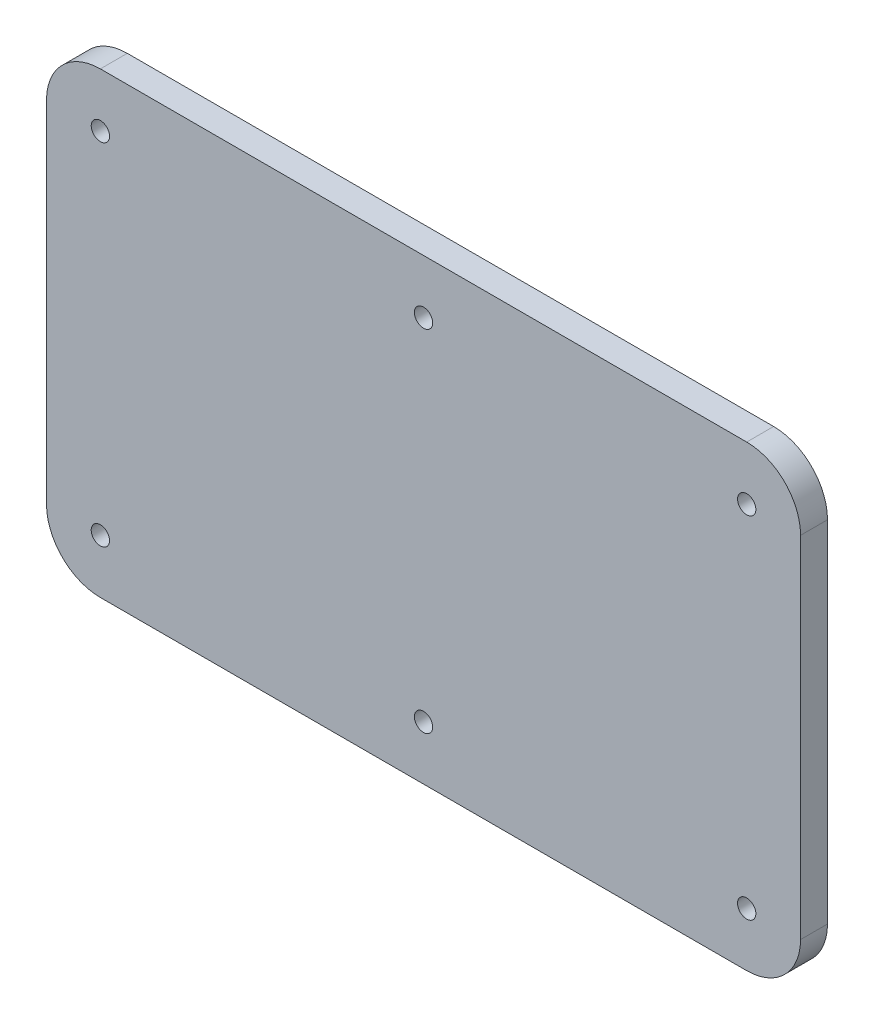
ISO-10303-21;
HEADER;
FILE_DESCRIPTION(('STEP AP214'),'2;1');
FILE_NAME('part.step','',(''),(''),'','','');
FILE_SCHEMA(('AUTOMOTIVE_DESIGN { 1 0 10303 214 1 1 1 1 }'));
ENDSEC;
DATA;
#1=APPLICATION_CONTEXT('core data for automotive mechanical design processes');
#2=APPLICATION_PROTOCOL_DEFINITION('international standard','automotive_design',2000,#1);
#3=PRODUCT_CONTEXT('',#1,'mechanical');
#4=PRODUCT('Part','Part','',(#3));
#5=PRODUCT_RELATED_PRODUCT_CATEGORY('part','',(#4));
#6=PRODUCT_DEFINITION_FORMATION('','',#4);
#7=PRODUCT_DEFINITION_CONTEXT('part definition',#1,'design');
#8=PRODUCT_DEFINITION('design','',#6,#7);
#9=PRODUCT_DEFINITION_SHAPE('','',#8);
#10=(LENGTH_UNIT() NAMED_UNIT(*) SI_UNIT(.MILLI.,.METRE.));
#11=(NAMED_UNIT(*) PLANE_ANGLE_UNIT() SI_UNIT($,.RADIAN.));
#12=(NAMED_UNIT(*) SI_UNIT($,.STERADIAN.) SOLID_ANGLE_UNIT());
#13=UNCERTAINTY_MEASURE_WITH_UNIT(LENGTH_MEASURE(1.E-05),#10,'distance_accuracy_value','');
#14=(GEOMETRIC_REPRESENTATION_CONTEXT(3) GLOBAL_UNCERTAINTY_ASSIGNED_CONTEXT((#13)) GLOBAL_UNIT_ASSIGNED_CONTEXT((#10,
#11,#12)) REPRESENTATION_CONTEXT('',''));
#15=CARTESIAN_POINT('',(0.,0.,0.));
#16=DIRECTION('',(0.,0.,1.));
#17=DIRECTION('',(1.,0.,0.));
#18=AXIS2_PLACEMENT_3D('',#15,#16,#17);
#19=CARTESIAN_POINT('',(-60.,32.5,5.));
#20=DIRECTION('',(0.,0.,1.));
#21=DIRECTION('',(1.,0.,0.));
#22=AXIS2_PLACEMENT_3D('',#19,#20,#21);
#23=PLANE('',#22);
#24=CARTESIAN_POINT('',(0.,32.5,5.));
#25=DIRECTION('',(0.,0.,1.));
#26=DIRECTION('',(1.,0.,0.));
#27=AXIS2_PLACEMENT_3D('',#24,#25,#26);
#28=CIRCLE('',#27,1.7);
#29=CARTESIAN_POINT('',(1.69999999999999,32.5,5.));
#30=VERTEX_POINT('',#29);
#31=EDGE_CURVE('E203',#30,#30,#28,.T.);
#32=ORIENTED_EDGE('',*,*,#31,.F.);
#33=EDGE_LOOP('',(#32));
#34=FACE_BOUND('',#33,.T.);
#35=CARTESIAN_POINT('',(60.,-32.5,5.));
#36=DIRECTION('',(0.,0.,1.));
#37=DIRECTION('',(1.,0.,0.));
#38=AXIS2_PLACEMENT_3D('',#35,#36,#37);
#39=CIRCLE('',#38,1.7);
#40=CARTESIAN_POINT('',(61.7,-32.5,5.));
#41=VERTEX_POINT('',#40);
#42=EDGE_CURVE('E191',#41,#41,#39,.T.);
#43=ORIENTED_EDGE('',*,*,#42,.F.);
#44=EDGE_LOOP('',(#43));
#45=FACE_BOUND('',#44,.T.);
#46=CARTESIAN_POINT('',(-60.,32.5,5.));
#47=DIRECTION('',(0.,0.,1.));
#48=DIRECTION('',(1.,0.,0.));
#49=AXIS2_PLACEMENT_3D('',#46,#47,#48);
#50=CIRCLE('',#49,1.7);
#51=CARTESIAN_POINT('',(-58.3,32.5,5.));
#52=VERTEX_POINT('',#51);
#53=EDGE_CURVE('E137',#52,#52,#50,.T.);
#54=ORIENTED_EDGE('',*,*,#53,.F.);
#55=EDGE_LOOP('',(#54));
#56=FACE_BOUND('',#55,.T.);
#57=CARTESIAN_POINT('',(-60.,32.5,5.));
#58=DIRECTION('',(0.,0.,1.));
#59=DIRECTION('',(1.,0.,0.));
#60=AXIS2_PLACEMENT_3D('',#57,#58,#59);
#61=CIRCLE('',#60,9.99999999999999);
#62=CARTESIAN_POINT('',(-59.9999999999999,42.5,5.));
#63=VERTEX_POINT('',#62);
#64=CARTESIAN_POINT('',(-70.,32.4999999999999,5.));
#65=VERTEX_POINT('',#64);
#66=EDGE_CURVE('E148',#63,#65,#61,.T.);
#67=ORIENTED_EDGE('',*,*,#66,.T.);
#68=DIRECTION('',(0.,-1.,0.));
#69=VECTOR('',#68,1.);
#70=CARTESIAN_POINT('',(-70.,-32.4999999999999,5.));
#71=LINE('',#70,#69);
#72=CARTESIAN_POINT('',(-70.,-32.5,5.));
#73=VERTEX_POINT('',#72);
#74=EDGE_CURVE('E96',#65,#73,#71,.T.);
#75=ORIENTED_EDGE('',*,*,#74,.T.);
#76=CARTESIAN_POINT('',(-60.,-32.5,5.));
#77=DIRECTION('',(0.,0.,1.));
#78=DIRECTION('',(-1.,0.,0.));
#79=AXIS2_PLACEMENT_3D('',#76,#77,#78);
#80=CIRCLE('',#79,9.99999999999999);
#81=CARTESIAN_POINT('',(-59.9999999999999,-42.5,5.));
#82=VERTEX_POINT('',#81);
#83=EDGE_CURVE('E163',#73,#82,#80,.T.);
#84=ORIENTED_EDGE('',*,*,#83,.T.);
#85=DIRECTION('',(1.,0.,0.));
#86=VECTOR('',#85,1.);
#87=CARTESIAN_POINT('',(-59.9999999999999,-42.5,5.));
#88=LINE('',#87,#86);
#89=CARTESIAN_POINT('',(59.9999999999999,-42.5,5.));
#90=VERTEX_POINT('',#89);
#91=EDGE_CURVE('E176',#82,#90,#88,.T.);
#92=ORIENTED_EDGE('',*,*,#91,.T.);
#93=CARTESIAN_POINT('',(60.,-32.5,5.));
#94=DIRECTION('',(0.,0.,1.));
#95=DIRECTION('',(-1.,0.,0.));
#96=AXIS2_PLACEMENT_3D('',#93,#94,#95);
#97=CIRCLE('',#96,9.99999999999999);
#98=CARTESIAN_POINT('',(70.,-32.4999999999999,5.));
#99=VERTEX_POINT('',#98);
#100=EDGE_CURVE('E115',#90,#99,#97,.T.);
#101=ORIENTED_EDGE('',*,*,#100,.T.);
#102=DIRECTION('',(0.,1.,0.));
#103=VECTOR('',#102,1.);
#104=CARTESIAN_POINT('',(70.,-32.4999999999999,5.));
#105=LINE('',#104,#103);
#106=CARTESIAN_POINT('',(70.,32.4999999999999,5.));
#107=VERTEX_POINT('',#106);
#108=EDGE_CURVE('E109',#99,#107,#105,.T.);
#109=ORIENTED_EDGE('',*,*,#108,.T.);
#110=CARTESIAN_POINT('',(60.,32.5,5.));
#111=DIRECTION('',(0.,0.,1.));
#112=DIRECTION('',(1.,0.,0.));
#113=AXIS2_PLACEMENT_3D('',#110,#111,#112);
#114=CIRCLE('',#113,9.99999999999999);
#115=CARTESIAN_POINT('',(59.9999999999999,42.5,5.));
#116=VERTEX_POINT('',#115);
#117=EDGE_CURVE('E113',#107,#116,#114,.T.);
#118=ORIENTED_EDGE('',*,*,#117,.T.);
#119=DIRECTION('',(-1.,0.,0.));
#120=VECTOR('',#119,1.);
#121=CARTESIAN_POINT('',(-59.9999999999999,42.5,5.));
#122=LINE('',#121,#120);
#123=EDGE_CURVE('E53',#116,#63,#122,.T.);
#124=ORIENTED_EDGE('',*,*,#123,.T.);
#125=EDGE_LOOP('',(#67,#75,#84,#92,#101,#109,#118,#124));
#126=FACE_BOUND('',#125,.T.);
#127=CARTESIAN_POINT('',(-60.,-32.5,5.));
#128=DIRECTION('',(0.,0.,1.));
#129=DIRECTION('',(1.,0.,0.));
#130=AXIS2_PLACEMENT_3D('',#127,#128,#129);
#131=CIRCLE('',#130,1.7);
#132=CARTESIAN_POINT('',(-58.3,-32.5,5.));
#133=VERTEX_POINT('',#132);
#134=EDGE_CURVE('E185',#133,#133,#131,.T.);
#135=ORIENTED_EDGE('',*,*,#134,.F.);
#136=EDGE_LOOP('',(#135));
#137=FACE_BOUND('',#136,.T.);
#138=CARTESIAN_POINT('',(60.,32.5,5.));
#139=DIRECTION('',(0.,0.,1.));
#140=DIRECTION('',(1.,0.,0.));
#141=AXIS2_PLACEMENT_3D('',#138,#139,#140);
#142=CIRCLE('',#141,1.7);
#143=CARTESIAN_POINT('',(61.7,32.5,5.));
#144=VERTEX_POINT('',#143);
#145=EDGE_CURVE('E197',#144,#144,#142,.T.);
#146=ORIENTED_EDGE('',*,*,#145,.F.);
#147=EDGE_LOOP('',(#146));
#148=FACE_BOUND('',#147,.T.);
#149=CARTESIAN_POINT('',(0.,-32.5,5.));
#150=DIRECTION('',(0.,0.,1.));
#151=DIRECTION('',(1.,0.,0.));
#152=AXIS2_PLACEMENT_3D('',#149,#150,#151);
#153=CIRCLE('',#152,1.7);
#154=CARTESIAN_POINT('',(1.69999999999999,-32.5,5.));
#155=VERTEX_POINT('',#154);
#156=EDGE_CURVE('E209',#155,#155,#153,.T.);
#157=ORIENTED_EDGE('',*,*,#156,.F.);
#158=EDGE_LOOP('',(#157));
#159=FACE_BOUND('',#158,.T.);
#160=ADVANCED_FACE('F36',(#34,#45,#56,#126,#137,#148,#159),#23,.T.);
#161=CARTESIAN_POINT('',(-60.,32.5,0.));
#162=DIRECTION('',(0.,0.,1.));
#163=DIRECTION('',(1.,0.,0.));
#164=AXIS2_PLACEMENT_3D('',#161,#162,#163);
#165=PLANE('',#164);
#166=CARTESIAN_POINT('',(-60.,32.5,0.));
#167=DIRECTION('',(0.,0.,1.));
#168=DIRECTION('',(1.,0.,0.));
#169=AXIS2_PLACEMENT_3D('',#166,#167,#168);
#170=CIRCLE('',#169,9.99999999999999);
#171=CARTESIAN_POINT('',(-59.9999999999999,42.5,0.));
#172=VERTEX_POINT('',#171);
#173=CARTESIAN_POINT('',(-70.,32.4999999999999,0.));
#174=VERTEX_POINT('',#173);
#175=EDGE_CURVE('E133',#172,#174,#170,.T.);
#176=ORIENTED_EDGE('',*,*,#175,.F.);
#177=DIRECTION('',(-1.,0.,0.));
#178=VECTOR('',#177,1.);
#179=CARTESIAN_POINT('',(-59.9999999999999,42.5,0.));
#180=LINE('',#179,#178);
#181=CARTESIAN_POINT('',(59.9999999999999,42.5,0.));
#182=VERTEX_POINT('',#181);
#183=EDGE_CURVE('E88',#182,#172,#180,.T.);
#184=ORIENTED_EDGE('',*,*,#183,.F.);
#185=CARTESIAN_POINT('',(60.,32.5,0.));
#186=DIRECTION('',(0.,0.,1.));
#187=DIRECTION('',(1.,0.,0.));
#188=AXIS2_PLACEMENT_3D('',#185,#186,#187);
#189=CIRCLE('',#188,9.99999999999999);
#190=CARTESIAN_POINT('',(70.,32.4999999999999,0.));
#191=VERTEX_POINT('',#190);
#192=EDGE_CURVE('E82',#191,#182,#189,.T.);
#193=ORIENTED_EDGE('',*,*,#192,.F.);
#194=DIRECTION('',(0.,1.,0.));
#195=VECTOR('',#194,1.);
#196=CARTESIAN_POINT('',(70.,-32.4999999999999,0.));
#197=LINE('',#196,#195);
#198=CARTESIAN_POINT('',(70.,-32.4999999999999,0.));
#199=VERTEX_POINT('',#198);
#200=EDGE_CURVE('E123',#199,#191,#197,.T.);
#201=ORIENTED_EDGE('',*,*,#200,.F.);
#202=CARTESIAN_POINT('',(60.,-32.5,0.));
#203=DIRECTION('',(0.,0.,1.));
#204=DIRECTION('',(-1.,0.,0.));
#205=AXIS2_PLACEMENT_3D('',#202,#203,#204);
#206=CIRCLE('',#205,9.99999999999999);
#207=CARTESIAN_POINT('',(59.9999999999999,-42.5,0.));
#208=VERTEX_POINT('',#207);
#209=EDGE_CURVE('E143',#208,#199,#206,.T.);
#210=ORIENTED_EDGE('',*,*,#209,.F.);
#211=DIRECTION('',(1.,0.,0.));
#212=VECTOR('',#211,1.);
#213=CARTESIAN_POINT('',(-59.9999999999999,-42.5,0.));
#214=LINE('',#213,#212);
#215=CARTESIAN_POINT('',(-59.9999999999999,-42.5,0.));
#216=VERTEX_POINT('',#215);
#217=EDGE_CURVE('E141',#216,#208,#214,.T.);
#218=ORIENTED_EDGE('',*,*,#217,.F.);
#219=CARTESIAN_POINT('',(-60.,-32.5,0.));
#220=DIRECTION('',(0.,0.,1.));
#221=DIRECTION('',(-1.,0.,0.));
#222=AXIS2_PLACEMENT_3D('',#219,#220,#221);
#223=CIRCLE('',#222,9.99999999999999);
#224=CARTESIAN_POINT('',(-70.,-32.5,0.));
#225=VERTEX_POINT('',#224);
#226=EDGE_CURVE('E139',#225,#216,#223,.T.);
#227=ORIENTED_EDGE('',*,*,#226,.F.);
#228=DIRECTION('',(0.,-1.,0.));
#229=VECTOR('',#228,1.);
#230=CARTESIAN_POINT('',(-70.,-32.4999999999999,0.));
#231=LINE('',#230,#229);
#232=EDGE_CURVE('E136',#174,#225,#231,.T.);
#233=ORIENTED_EDGE('',*,*,#232,.F.);
#234=EDGE_LOOP('',(#176,#184,#193,#201,#210,#218,#227,#233));
#235=FACE_BOUND('',#234,.T.);
#236=CARTESIAN_POINT('',(-60.,32.5,0.));
#237=DIRECTION('',(0.,0.,1.));
#238=DIRECTION('',(1.,0.,0.));
#239=AXIS2_PLACEMENT_3D('',#236,#237,#238);
#240=CIRCLE('',#239,1.7);
#241=CARTESIAN_POINT('',(-58.3,32.5,0.));
#242=VERTEX_POINT('',#241);
#243=EDGE_CURVE('E182',#242,#242,#240,.T.);
#244=ORIENTED_EDGE('',*,*,#243,.T.);
#245=EDGE_LOOP('',(#244));
#246=FACE_BOUND('',#245,.T.);
#247=CARTESIAN_POINT('',(-60.,-32.5,0.));
#248=DIRECTION('',(0.,0.,1.));
#249=DIRECTION('',(1.,0.,0.));
#250=AXIS2_PLACEMENT_3D('',#247,#248,#249);
#251=CIRCLE('',#250,1.7);
#252=CARTESIAN_POINT('',(-58.3,-32.5,0.));
#253=VERTEX_POINT('',#252);
#254=EDGE_CURVE('E188',#253,#253,#251,.T.);
#255=ORIENTED_EDGE('',*,*,#254,.T.);
#256=EDGE_LOOP('',(#255));
#257=FACE_BOUND('',#256,.T.);
#258=CARTESIAN_POINT('',(60.,-32.5,0.));
#259=DIRECTION('',(0.,0.,1.));
#260=DIRECTION('',(1.,0.,0.));
#261=AXIS2_PLACEMENT_3D('',#258,#259,#260);
#262=CIRCLE('',#261,1.7);
#263=CARTESIAN_POINT('',(61.7,-32.5,0.));
#264=VERTEX_POINT('',#263);
#265=EDGE_CURVE('E194',#264,#264,#262,.T.);
#266=ORIENTED_EDGE('',*,*,#265,.T.);
#267=EDGE_LOOP('',(#266));
#268=FACE_BOUND('',#267,.T.);
#269=CARTESIAN_POINT('',(60.,32.5,0.));
#270=DIRECTION('',(0.,0.,1.));
#271=DIRECTION('',(1.,0.,0.));
#272=AXIS2_PLACEMENT_3D('',#269,#270,#271);
#273=CIRCLE('',#272,1.7);
#274=CARTESIAN_POINT('',(61.7,32.5,0.));
#275=VERTEX_POINT('',#274);
#276=EDGE_CURVE('E200',#275,#275,#273,.T.);
#277=ORIENTED_EDGE('',*,*,#276,.T.);
#278=EDGE_LOOP('',(#277));
#279=FACE_BOUND('',#278,.T.);
#280=CARTESIAN_POINT('',(0.,32.5,0.));
#281=DIRECTION('',(0.,0.,1.));
#282=DIRECTION('',(1.,0.,0.));
#283=AXIS2_PLACEMENT_3D('',#280,#281,#282);
#284=CIRCLE('',#283,1.7);
#285=CARTESIAN_POINT('',(1.69999999999999,32.5,0.));
#286=VERTEX_POINT('',#285);
#287=EDGE_CURVE('E206',#286,#286,#284,.T.);
#288=ORIENTED_EDGE('',*,*,#287,.T.);
#289=EDGE_LOOP('',(#288));
#290=FACE_BOUND('',#289,.T.);
#291=CARTESIAN_POINT('',(0.,-32.5,0.));
#292=DIRECTION('',(0.,0.,1.));
#293=DIRECTION('',(1.,0.,0.));
#294=AXIS2_PLACEMENT_3D('',#291,#292,#293);
#295=CIRCLE('',#294,1.7);
#296=CARTESIAN_POINT('',(1.69999999999999,-32.5,0.));
#297=VERTEX_POINT('',#296);
#298=EDGE_CURVE('E212',#297,#297,#295,.T.);
#299=ORIENTED_EDGE('',*,*,#298,.T.);
#300=EDGE_LOOP('',(#299));
#301=FACE_BOUND('',#300,.T.);
#302=ADVANCED_FACE('F167',(#235,#246,#257,#268,#279,#290,#301),#165,.F.);
#303=CARTESIAN_POINT('',(-60.,32.5,5.));
#304=DIRECTION('',(0.,0.,-1.));
#305=DIRECTION('',(-1.,0.,0.));
#306=AXIS2_PLACEMENT_3D('',#303,#304,#305);
#307=CYLINDRICAL_SURFACE('',#306,9.99999999999999);
#308=ORIENTED_EDGE('',*,*,#175,.T.);
#309=DIRECTION('',(0.,0.,-1.));
#310=VECTOR('',#309,1.);
#311=CARTESIAN_POINT('',(-70.,32.4999999999999,5.));
#312=LINE('',#311,#310);
#313=EDGE_CURVE('E11',#65,#174,#312,.T.);
#314=ORIENTED_EDGE('',*,*,#313,.F.);
#315=ORIENTED_EDGE('',*,*,#66,.F.);
#316=DIRECTION('',(0.,0.,-1.));
#317=VECTOR('',#316,1.);
#318=CARTESIAN_POINT('',(-59.9999999999999,42.5,5.));
#319=LINE('',#318,#317);
#320=EDGE_CURVE('E129',#63,#172,#319,.T.);
#321=ORIENTED_EDGE('',*,*,#320,.T.);
#322=EDGE_LOOP('',(#308,#314,#315,#321));
#323=FACE_BOUND('',#322,.T.);
#324=ADVANCED_FACE('F38',(#323),#307,.T.);
#325=CARTESIAN_POINT('',(-70.,-32.4999999999999,5.));
#326=DIRECTION('',(1.,0.,0.));
#327=DIRECTION('',(0.,0.,-1.));
#328=AXIS2_PLACEMENT_3D('',#325,#326,#327);
#329=PLANE('',#328);
#330=ORIENTED_EDGE('',*,*,#232,.T.);
#331=DIRECTION('',(0.,0.,-1.));
#332=VECTOR('',#331,1.);
#333=CARTESIAN_POINT('',(-70.,-32.5,5.));
#334=LINE('',#333,#332);
#335=EDGE_CURVE('E45',#73,#225,#334,.T.);
#336=ORIENTED_EDGE('',*,*,#335,.F.);
#337=ORIENTED_EDGE('',*,*,#74,.F.);
#338=ORIENTED_EDGE('',*,*,#313,.T.);
#339=EDGE_LOOP('',(#330,#336,#337,#338));
#340=FACE_BOUND('',#339,.T.);
#341=ADVANCED_FACE('F246',(#340),#329,.F.);
#342=CARTESIAN_POINT('',(-60.,-32.5,5.));
#343=DIRECTION('',(0.,0.,-1.));
#344=DIRECTION('',(-1.,0.,0.));
#345=AXIS2_PLACEMENT_3D('',#342,#343,#344);
#346=CYLINDRICAL_SURFACE('',#345,9.99999999999999);
#347=ORIENTED_EDGE('',*,*,#226,.T.);
#348=DIRECTION('',(0.,0.,-1.));
#349=VECTOR('',#348,1.);
#350=CARTESIAN_POINT('',(-59.9999999999999,-42.5,5.));
#351=LINE('',#350,#349);
#352=EDGE_CURVE('E155',#82,#216,#351,.T.);
#353=ORIENTED_EDGE('',*,*,#352,.F.);
#354=ORIENTED_EDGE('',*,*,#83,.F.);
#355=ORIENTED_EDGE('',*,*,#335,.T.);
#356=EDGE_LOOP('',(#347,#353,#354,#355));
#357=FACE_BOUND('',#356,.T.);
#358=ADVANCED_FACE('F161',(#357),#346,.T.);
#359=CARTESIAN_POINT('',(-59.9999999999999,-42.5,5.));
#360=DIRECTION('',(0.,1.,0.));
#361=DIRECTION('',(0.,0.,1.));
#362=AXIS2_PLACEMENT_3D('',#359,#360,#361);
#363=PLANE('',#362);
#364=ORIENTED_EDGE('',*,*,#217,.T.);
#365=DIRECTION('',(0.,0.,-1.));
#366=VECTOR('',#365,1.);
#367=CARTESIAN_POINT('',(59.9999999999999,-42.5,5.));
#368=LINE('',#367,#366);
#369=EDGE_CURVE('E152',#90,#208,#368,.T.);
#370=ORIENTED_EDGE('',*,*,#369,.F.);
#371=ORIENTED_EDGE('',*,*,#91,.F.);
#372=ORIENTED_EDGE('',*,*,#352,.T.);
#373=EDGE_LOOP('',(#364,#370,#371,#372));
#374=FACE_BOUND('',#373,.T.);
#375=ADVANCED_FACE('F172',(#374),#363,.F.);
#376=CARTESIAN_POINT('',(60.,-32.5,5.));
#377=DIRECTION('',(0.,0.,-1.));
#378=DIRECTION('',(-1.,0.,0.));
#379=AXIS2_PLACEMENT_3D('',#376,#377,#378);
#380=CYLINDRICAL_SURFACE('',#379,9.99999999999999);
#381=ORIENTED_EDGE('',*,*,#209,.T.);
#382=DIRECTION('',(0.,0.,-1.));
#383=VECTOR('',#382,1.);
#384=CARTESIAN_POINT('',(70.,-32.4999999999999,5.));
#385=LINE('',#384,#383);
#386=EDGE_CURVE('E124',#99,#199,#385,.T.);
#387=ORIENTED_EDGE('',*,*,#386,.F.);
#388=ORIENTED_EDGE('',*,*,#100,.F.);
#389=ORIENTED_EDGE('',*,*,#369,.T.);
#390=EDGE_LOOP('',(#381,#387,#388,#389));
#391=FACE_BOUND('',#390,.T.);
#392=ADVANCED_FACE('F175',(#391),#380,.T.);
#393=CARTESIAN_POINT('',(70.,-32.4999999999999,5.));
#394=DIRECTION('',(-1.,0.,0.));
#395=DIRECTION('',(0.,0.,1.));
#396=AXIS2_PLACEMENT_3D('',#393,#394,#395);
#397=PLANE('',#396);
#398=ORIENTED_EDGE('',*,*,#200,.T.);
#399=DIRECTION('',(0.,0.,-1.));
#400=VECTOR('',#399,1.);
#401=CARTESIAN_POINT('',(70.,32.4999999999999,5.));
#402=LINE('',#401,#400);
#403=EDGE_CURVE('E120',#107,#191,#402,.T.);
#404=ORIENTED_EDGE('',*,*,#403,.F.);
#405=ORIENTED_EDGE('',*,*,#108,.F.);
#406=ORIENTED_EDGE('',*,*,#386,.T.);
#407=EDGE_LOOP('',(#398,#404,#405,#406));
#408=FACE_BOUND('',#407,.T.);
#409=ADVANCED_FACE('F121',(#408),#397,.F.);
#410=CARTESIAN_POINT('',(60.,32.5,5.));
#411=DIRECTION('',(0.,0.,-1.));
#412=DIRECTION('',(-1.,0.,0.));
#413=AXIS2_PLACEMENT_3D('',#410,#411,#412);
#414=CYLINDRICAL_SURFACE('',#413,9.99999999999999);
#415=ORIENTED_EDGE('',*,*,#192,.T.);
#416=DIRECTION('',(0.,0.,-1.));
#417=VECTOR('',#416,1.);
#418=CARTESIAN_POINT('',(59.9999999999999,42.5,5.));
#419=LINE('',#418,#417);
#420=EDGE_CURVE('E125',#116,#182,#419,.T.);
#421=ORIENTED_EDGE('',*,*,#420,.F.);
#422=ORIENTED_EDGE('',*,*,#117,.F.);
#423=ORIENTED_EDGE('',*,*,#403,.T.);
#424=EDGE_LOOP('',(#415,#421,#422,#423));
#425=FACE_BOUND('',#424,.T.);
#426=ADVANCED_FACE('F127',(#425),#414,.T.);
#427=CARTESIAN_POINT('',(-59.9999999999999,42.5,5.));
#428=DIRECTION('',(0.,-1.,0.));
#429=DIRECTION('',(0.,0.,-1.));
#430=AXIS2_PLACEMENT_3D('',#427,#428,#429);
#431=PLANE('',#430);
#432=ORIENTED_EDGE('',*,*,#183,.T.);
#433=ORIENTED_EDGE('',*,*,#320,.F.);
#434=ORIENTED_EDGE('',*,*,#123,.F.);
#435=ORIENTED_EDGE('',*,*,#420,.T.);
#436=EDGE_LOOP('',(#432,#433,#434,#435));
#437=FACE_BOUND('',#436,.T.);
#438=ADVANCED_FACE('F234',(#437),#431,.F.);
#439=CARTESIAN_POINT('',(-60.,32.5,5.));
#440=DIRECTION('',(0.,0.,-1.));
#441=DIRECTION('',(-1.,0.,0.));
#442=AXIS2_PLACEMENT_3D('',#439,#440,#441);
#443=CYLINDRICAL_SURFACE('',#442,1.7);
#444=ORIENTED_EDGE('',*,*,#53,.T.);
#445=EDGE_LOOP('',(#444));
#446=FACE_BOUND('',#445,.T.);
#447=ORIENTED_EDGE('',*,*,#243,.F.);
#448=EDGE_LOOP('',(#447));
#449=FACE_BOUND('',#448,.T.);
#450=ADVANCED_FACE('F231',(#446,#449),#443,.F.);
#451=CARTESIAN_POINT('',(-60.,-32.5,5.));
#452=DIRECTION('',(0.,0.,-1.));
#453=DIRECTION('',(-1.,0.,0.));
#454=AXIS2_PLACEMENT_3D('',#451,#452,#453);
#455=CYLINDRICAL_SURFACE('',#454,1.7);
#456=ORIENTED_EDGE('',*,*,#134,.T.);
#457=EDGE_LOOP('',(#456));
#458=FACE_BOUND('',#457,.T.);
#459=ORIENTED_EDGE('',*,*,#254,.F.);
#460=EDGE_LOOP('',(#459));
#461=FACE_BOUND('',#460,.T.);
#462=ADVANCED_FACE('F310',(#458,#461),#455,.F.);
#463=CARTESIAN_POINT('',(60.,-32.5,5.));
#464=DIRECTION('',(0.,0.,-1.));
#465=DIRECTION('',(-1.,0.,0.));
#466=AXIS2_PLACEMENT_3D('',#463,#464,#465);
#467=CYLINDRICAL_SURFACE('',#466,1.7);
#468=ORIENTED_EDGE('',*,*,#42,.T.);
#469=EDGE_LOOP('',(#468));
#470=FACE_BOUND('',#469,.T.);
#471=ORIENTED_EDGE('',*,*,#265,.F.);
#472=EDGE_LOOP('',(#471));
#473=FACE_BOUND('',#472,.T.);
#474=ADVANCED_FACE('F318',(#470,#473),#467,.F.);
#475=CARTESIAN_POINT('',(60.,32.5,5.));
#476=DIRECTION('',(0.,0.,-1.));
#477=DIRECTION('',(-1.,0.,0.));
#478=AXIS2_PLACEMENT_3D('',#475,#476,#477);
#479=CYLINDRICAL_SURFACE('',#478,1.7);
#480=ORIENTED_EDGE('',*,*,#145,.T.);
#481=EDGE_LOOP('',(#480));
#482=FACE_BOUND('',#481,.T.);
#483=ORIENTED_EDGE('',*,*,#276,.F.);
#484=EDGE_LOOP('',(#483));
#485=FACE_BOUND('',#484,.T.);
#486=ADVANCED_FACE('F326',(#482,#485),#479,.F.);
#487=CARTESIAN_POINT('',(0.,32.5,5.));
#488=DIRECTION('',(0.,0.,-1.));
#489=DIRECTION('',(-1.,0.,0.));
#490=AXIS2_PLACEMENT_3D('',#487,#488,#489);
#491=CYLINDRICAL_SURFACE('',#490,1.7);
#492=ORIENTED_EDGE('',*,*,#31,.T.);
#493=EDGE_LOOP('',(#492));
#494=FACE_BOUND('',#493,.T.);
#495=ORIENTED_EDGE('',*,*,#287,.F.);
#496=EDGE_LOOP('',(#495));
#497=FACE_BOUND('',#496,.T.);
#498=ADVANCED_FACE('F335',(#494,#497),#491,.F.);
#499=CARTESIAN_POINT('',(0.,-32.5,5.));
#500=DIRECTION('',(0.,0.,-1.));
#501=DIRECTION('',(-1.,0.,0.));
#502=AXIS2_PLACEMENT_3D('',#499,#500,#501);
#503=CYLINDRICAL_SURFACE('',#502,1.7);
#504=ORIENTED_EDGE('',*,*,#156,.T.);
#505=EDGE_LOOP('',(#504));
#506=FACE_BOUND('',#505,.T.);
#507=ORIENTED_EDGE('',*,*,#298,.F.);
#508=EDGE_LOOP('',(#507));
#509=FACE_BOUND('',#508,.T.);
#510=ADVANCED_FACE('F218',(#506,#509),#503,.F.);
#511=CLOSED_SHELL('',(#160,#302,#324,#341,#358,#375,#392,#409,#426,#438,#450,#462,#474,#486,
#498,#510));
#512=MANIFOLD_SOLID_BREP('B2',#511);
#513=ADVANCED_BREP_SHAPE_REPRESENTATION('',(#18,#512),#14);
#514=SHAPE_DEFINITION_REPRESENTATION(#9,#513);
ENDSEC;
END-ISO-10303-21;
